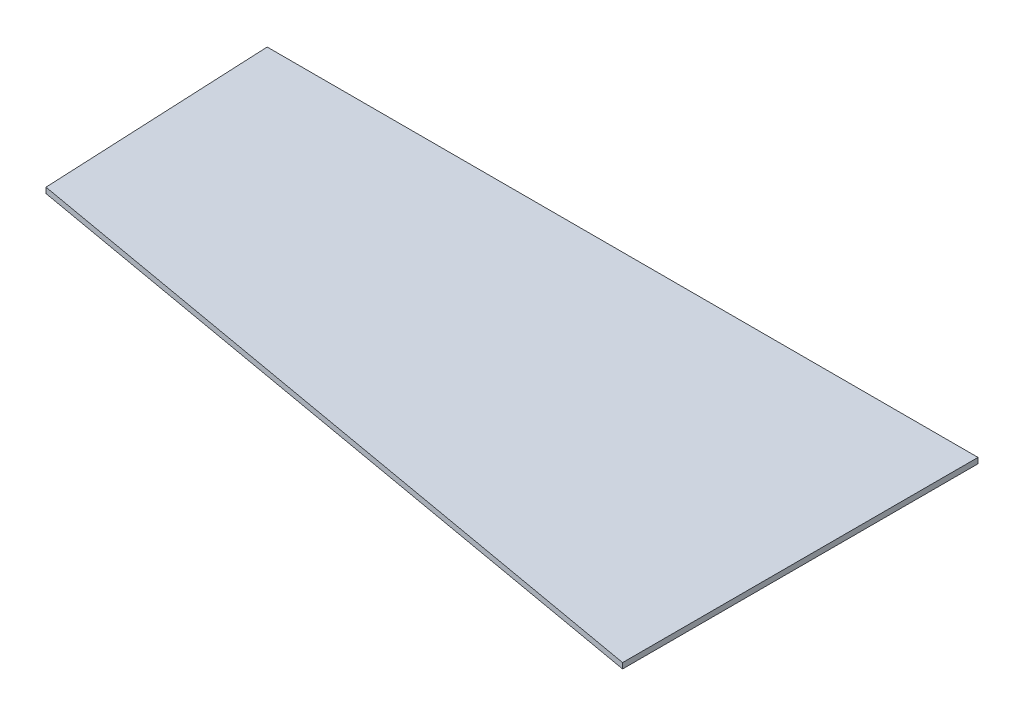
ISO-10303-21;
HEADER;
FILE_DESCRIPTION(('STEP AP214'),'2;1');
FILE_NAME('part.step','',(''),(''),'','','');
FILE_SCHEMA(('AUTOMOTIVE_DESIGN { 1 0 10303 214 1 1 1 1 }'));
ENDSEC;
DATA;
#1=APPLICATION_CONTEXT('core data for automotive mechanical design processes');
#2=APPLICATION_PROTOCOL_DEFINITION('international standard','automotive_design',2000,#1);
#3=PRODUCT_CONTEXT('',#1,'mechanical');
#4=PRODUCT('Part','Part','',(#3));
#5=PRODUCT_RELATED_PRODUCT_CATEGORY('part','',(#4));
#6=PRODUCT_DEFINITION_FORMATION('','',#4);
#7=PRODUCT_DEFINITION_CONTEXT('part definition',#1,'design');
#8=PRODUCT_DEFINITION('design','',#6,#7);
#9=PRODUCT_DEFINITION_SHAPE('','',#8);
#10=(LENGTH_UNIT() NAMED_UNIT(*) SI_UNIT(.MILLI.,.METRE.));
#11=(NAMED_UNIT(*) PLANE_ANGLE_UNIT() SI_UNIT($,.RADIAN.));
#12=(NAMED_UNIT(*) SI_UNIT($,.STERADIAN.) SOLID_ANGLE_UNIT());
#13=UNCERTAINTY_MEASURE_WITH_UNIT(LENGTH_MEASURE(1.E-05),#10,'distance_accuracy_value','');
#14=(GEOMETRIC_REPRESENTATION_CONTEXT(3) GLOBAL_UNCERTAINTY_ASSIGNED_CONTEXT((#13)) GLOBAL_UNIT_ASSIGNED_CONTEXT((#10,
#11,#12)) REPRESENTATION_CONTEXT('',''));
#15=CARTESIAN_POINT('',(0.,0.,0.));
#16=DIRECTION('',(0.,0.,1.));
#17=DIRECTION('',(1.,0.,0.));
#18=AXIS2_PLACEMENT_3D('',#15,#16,#17);
#19=CARTESIAN_POINT('',(-2438.4,19.05,-1219.2));
#20=DIRECTION('',(0.998918225383644,0.,-0.0465013870372923));
#21=DIRECTION('',(-0.0465013870372923,0.,-0.998918225383644));
#22=AXIS2_PLACEMENT_3D('',#19,#20,#21);
#23=PLANE('',#22);
#24=DIRECTION('',(0.0465013870372923,0.,0.998918225383644));
#25=VECTOR('',#24,1.);
#26=CARTESIAN_POINT('',(-2438.4,0.,-1219.2));
#27=LINE('',#26,#25);
#28=CARTESIAN_POINT('',(-2438.4,0.,-1219.2));
#29=VERTEX_POINT('',#28);
#30=CARTESIAN_POINT('',(-2401.35522494497,0.,-423.423716423053));
#31=VERTEX_POINT('',#30);
#32=EDGE_CURVE('E107',#29,#31,#27,.T.);
#33=ORIENTED_EDGE('',*,*,#32,.T.);
#34=DIRECTION('',(0.,-1.,0.));
#35=VECTOR('',#34,1.);
#36=CARTESIAN_POINT('',(-2401.35522494497,19.05,-423.423716423053));
#37=LINE('',#36,#35);
#38=CARTESIAN_POINT('',(-2401.35522494497,19.05,-423.423716423053));
#39=VERTEX_POINT('',#38);
#40=EDGE_CURVE('E11',#39,#31,#37,.T.);
#41=ORIENTED_EDGE('',*,*,#40,.F.);
#42=DIRECTION('',(0.0465013870372923,0.,0.998918225383644));
#43=VECTOR('',#42,1.);
#44=CARTESIAN_POINT('',(-2438.4,19.05,-1219.2));
#45=LINE('',#44,#43);
#46=CARTESIAN_POINT('',(-2438.4,19.05,-1219.2));
#47=VERTEX_POINT('',#46);
#48=EDGE_CURVE('E91',#47,#39,#45,.T.);
#49=ORIENTED_EDGE('',*,*,#48,.F.);
#50=DIRECTION('',(0.,-1.,0.));
#51=VECTOR('',#50,1.);
#52=CARTESIAN_POINT('',(-2438.4,19.05,-1219.2));
#53=LINE('',#52,#51);
#54=EDGE_CURVE('E103',#47,#29,#53,.T.);
#55=ORIENTED_EDGE('',*,*,#54,.T.);
#56=EDGE_LOOP('',(#33,#41,#49,#55));
#57=FACE_BOUND('',#56,.T.);
#58=ADVANCED_FACE('F39',(#57),#23,.F.);
#59=CARTESIAN_POINT('',(-2401.35522494497,19.05,-423.423716423053));
#60=DIRECTION('',(0.173648177666934,0.,-0.984807753012207));
#61=DIRECTION('',(-0.984807753012207,0.,-0.173648177666934));
#62=AXIS2_PLACEMENT_3D('',#59,#60,#61);
#63=PLANE('',#62);
#64=DIRECTION('',(0.984807753012207,0.,0.173648177666934));
#65=VECTOR('',#64,1.);
#66=CARTESIAN_POINT('',(-2401.35522494497,0.,-423.423716423053));
#67=LINE('',#66,#65);
#68=CARTESIAN_POINT('',(0.,0.,0.));
#69=VERTEX_POINT('',#68);
#70=EDGE_CURVE('E96',#31,#69,#67,.T.);
#71=ORIENTED_EDGE('',*,*,#70,.T.);
#72=DIRECTION('',(0.,-1.,0.));
#73=VECTOR('',#72,1.);
#74=CARTESIAN_POINT('',(0.,19.05,0.));
#75=LINE('',#74,#73);
#76=CARTESIAN_POINT('',(0.,19.05,0.));
#77=VERTEX_POINT('',#76);
#78=EDGE_CURVE('E48',#77,#69,#75,.T.);
#79=ORIENTED_EDGE('',*,*,#78,.F.);
#80=DIRECTION('',(0.984807753012207,0.,0.173648177666934));
#81=VECTOR('',#80,1.);
#82=CARTESIAN_POINT('',(-2401.35522494497,19.05,-423.423716423053));
#83=LINE('',#82,#81);
#84=EDGE_CURVE('E86',#39,#77,#83,.T.);
#85=ORIENTED_EDGE('',*,*,#84,.F.);
#86=ORIENTED_EDGE('',*,*,#40,.T.);
#87=EDGE_LOOP('',(#71,#79,#85,#86));
#88=FACE_BOUND('',#87,.T.);
#89=ADVANCED_FACE('F95',(#88),#63,.F.);
#90=CARTESIAN_POINT('',(0.,19.05,0.));
#91=DIRECTION('',(-1.,0.,0.));
#92=DIRECTION('',(0.,0.,1.));
#93=AXIS2_PLACEMENT_3D('',#90,#91,#92);
#94=PLANE('',#93);
#95=DIRECTION('',(0.,0.,-1.));
#96=VECTOR('',#95,1.);
#97=CARTESIAN_POINT('',(0.,0.,0.));
#98=LINE('',#97,#96);
#99=CARTESIAN_POINT('',(0.,0.,-1219.2));
#100=VERTEX_POINT('',#99);
#101=EDGE_CURVE('E73',#69,#100,#98,.T.);
#102=ORIENTED_EDGE('',*,*,#101,.T.);
#103=DIRECTION('',(0.,-1.,0.));
#104=VECTOR('',#103,1.);
#105=CARTESIAN_POINT('',(0.,19.05,-1219.2));
#106=LINE('',#105,#104);
#107=CARTESIAN_POINT('',(0.,19.05,-1219.2));
#108=VERTEX_POINT('',#107);
#109=EDGE_CURVE('E98',#108,#100,#106,.T.);
#110=ORIENTED_EDGE('',*,*,#109,.F.);
#111=DIRECTION('',(0.,0.,-1.));
#112=VECTOR('',#111,1.);
#113=CARTESIAN_POINT('',(0.,19.05,0.));
#114=LINE('',#113,#112);
#115=EDGE_CURVE('E89',#77,#108,#114,.T.);
#116=ORIENTED_EDGE('',*,*,#115,.F.);
#117=ORIENTED_EDGE('',*,*,#78,.T.);
#118=EDGE_LOOP('',(#102,#110,#116,#117));
#119=FACE_BOUND('',#118,.T.);
#120=ADVANCED_FACE('F99',(#119),#94,.F.);
#121=CARTESIAN_POINT('',(0.,19.05,-1219.2));
#122=DIRECTION('',(0.,0.,1.));
#123=DIRECTION('',(1.,0.,0.));
#124=AXIS2_PLACEMENT_3D('',#121,#122,#123);
#125=PLANE('',#124);
#126=DIRECTION('',(-1.,0.,0.));
#127=VECTOR('',#126,1.);
#128=CARTESIAN_POINT('',(0.,0.,-1219.2));
#129=LINE('',#128,#127);
#130=EDGE_CURVE('E79',#100,#29,#129,.T.);
#131=ORIENTED_EDGE('',*,*,#130,.T.);
#132=ORIENTED_EDGE('',*,*,#54,.F.);
#133=DIRECTION('',(-1.,0.,0.));
#134=VECTOR('',#133,1.);
#135=CARTESIAN_POINT('',(0.,19.05,-1219.2));
#136=LINE('',#135,#134);
#137=EDGE_CURVE('E56',#108,#47,#136,.T.);
#138=ORIENTED_EDGE('',*,*,#137,.F.);
#139=ORIENTED_EDGE('',*,*,#109,.T.);
#140=EDGE_LOOP('',(#131,#132,#138,#139));
#141=FACE_BOUND('',#140,.T.);
#142=ADVANCED_FACE('F120',(#141),#125,.F.);
#143=CARTESIAN_POINT('',(0.,19.05,0.));
#144=DIRECTION('',(0.,-1.,0.));
#145=DIRECTION('',(0.,0.,-1.));
#146=AXIS2_PLACEMENT_3D('',#143,#144,#145);
#147=PLANE('',#146);
#148=ORIENTED_EDGE('',*,*,#48,.T.);
#149=ORIENTED_EDGE('',*,*,#84,.T.);
#150=ORIENTED_EDGE('',*,*,#115,.T.);
#151=ORIENTED_EDGE('',*,*,#137,.T.);
#152=EDGE_LOOP('',(#148,#149,#150,#151));
#153=FACE_BOUND('',#152,.T.);
#154=ADVANCED_FACE('F87',(#153),#147,.F.);
#155=CARTESIAN_POINT('',(0.,0.,0.));
#156=DIRECTION('',(0.,-1.,0.));
#157=DIRECTION('',(0.,0.,-1.));
#158=AXIS2_PLACEMENT_3D('',#155,#156,#157);
#159=PLANE('',#158);
#160=ORIENTED_EDGE('',*,*,#32,.F.);
#161=ORIENTED_EDGE('',*,*,#130,.F.);
#162=ORIENTED_EDGE('',*,*,#101,.F.);
#163=ORIENTED_EDGE('',*,*,#70,.F.);
#164=EDGE_LOOP('',(#160,#161,#162,#163));
#165=FACE_BOUND('',#164,.T.);
#166=ADVANCED_FACE('F123',(#165),#159,.T.);
#167=CLOSED_SHELL('',(#58,#89,#120,#142,#154,#166));
#168=MANIFOLD_SOLID_BREP('B2',#167);
#169=ADVANCED_BREP_SHAPE_REPRESENTATION('',(#18,#168),#14);
#170=SHAPE_DEFINITION_REPRESENTATION(#9,#169);
ENDSEC;
END-ISO-10303-21;
